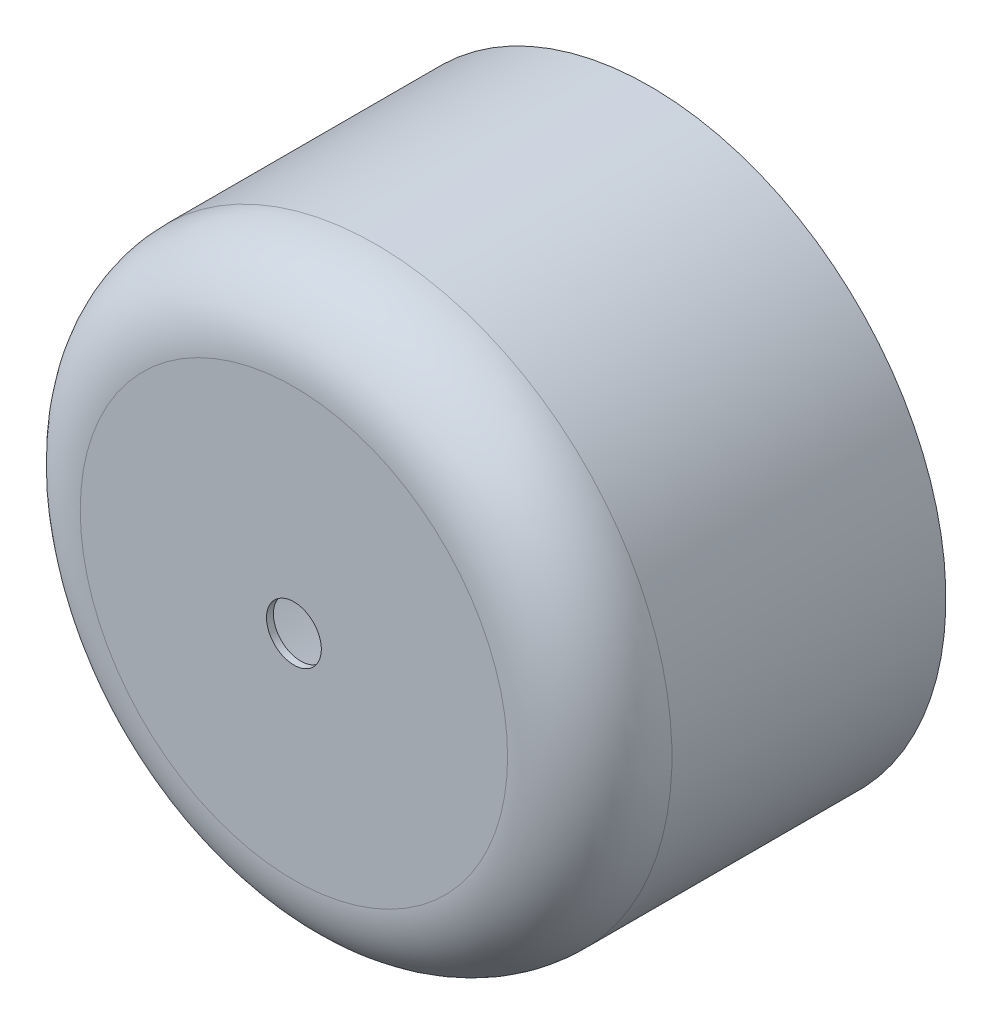
ISO-10303-21;
HEADER;
FILE_DESCRIPTION(('STEP AP214'),'2;1');
FILE_NAME('part.step','',(''),(''),'','','');
FILE_SCHEMA(('AUTOMOTIVE_DESIGN { 1 0 10303 214 1 1 1 1 }'));
ENDSEC;
DATA;
#1=APPLICATION_CONTEXT('core data for automotive mechanical design processes');
#2=APPLICATION_PROTOCOL_DEFINITION('international standard','automotive_design',2000,#1);
#3=PRODUCT_CONTEXT('',#1,'mechanical');
#4=PRODUCT('Part','Part','',(#3));
#5=PRODUCT_RELATED_PRODUCT_CATEGORY('part','',(#4));
#6=PRODUCT_DEFINITION_FORMATION('','',#4);
#7=PRODUCT_DEFINITION_CONTEXT('part definition',#1,'design');
#8=PRODUCT_DEFINITION('design','',#6,#7);
#9=PRODUCT_DEFINITION_SHAPE('','',#8);
#10=(LENGTH_UNIT() NAMED_UNIT(*) SI_UNIT(.MILLI.,.METRE.));
#11=(NAMED_UNIT(*) PLANE_ANGLE_UNIT() SI_UNIT($,.RADIAN.));
#12=(NAMED_UNIT(*) SI_UNIT($,.STERADIAN.) SOLID_ANGLE_UNIT());
#13=UNCERTAINTY_MEASURE_WITH_UNIT(LENGTH_MEASURE(1.E-05),#10,'distance_accuracy_value','');
#14=(GEOMETRIC_REPRESENTATION_CONTEXT(3) GLOBAL_UNCERTAINTY_ASSIGNED_CONTEXT((#13)) GLOBAL_UNIT_ASSIGNED_CONTEXT((#10,
#11,#12)) REPRESENTATION_CONTEXT('',''));
#15=CARTESIAN_POINT('',(0.,0.,0.));
#16=DIRECTION('',(0.,0.,1.));
#17=DIRECTION('',(1.,0.,0.));
#18=AXIS2_PLACEMENT_3D('',#15,#16,#17);
#19=CARTESIAN_POINT('',(10.55,0.,0.));
#20=DIRECTION('',(0.,0.,-1.));
#21=DIRECTION('',(-1.,0.,0.));
#22=AXIS2_PLACEMENT_3D('',#19,#20,#21);
#23=PLANE('',#22);
#24=CARTESIAN_POINT('',(0.,0.,0.));
#25=DIRECTION('',(0.,0.,-1.));
#26=DIRECTION('',(-1.,0.,0.));
#27=AXIS2_PLACEMENT_3D('',#24,#25,#26);
#28=CIRCLE('',#27,10.8);
#29=CARTESIAN_POINT('',(-10.8,0.,0.));
#30=VERTEX_POINT('',#29);
#31=EDGE_CURVE('E10',#30,#30,#28,.T.);
#32=ORIENTED_EDGE('',*,*,#31,.T.);
#33=EDGE_LOOP('',(#32));
#34=FACE_BOUND('',#33,.T.);
#35=CARTESIAN_POINT('',(0.,0.,0.));
#36=DIRECTION('',(0.,0.,-1.));
#37=DIRECTION('',(-1.,0.,0.));
#38=AXIS2_PLACEMENT_3D('',#35,#36,#37);
#39=CIRCLE('',#38,10.55);
#40=CARTESIAN_POINT('',(-10.55,0.,0.));
#41=VERTEX_POINT('',#40);
#42=EDGE_CURVE('E60',#41,#41,#39,.T.);
#43=ORIENTED_EDGE('',*,*,#42,.F.);
#44=EDGE_LOOP('',(#43));
#45=FACE_BOUND('',#44,.T.);
#46=ADVANCED_FACE('F32',(#34,#45),#23,.T.);
#47=CARTESIAN_POINT('',(0.,0.,13.));
#48=DIRECTION('',(0.,0.,-1.));
#49=DIRECTION('',(-1.,0.,0.));
#50=AXIS2_PLACEMENT_3D('',#47,#48,#49);
#51=CYLINDRICAL_SURFACE('',#50,10.8);
#52=CARTESIAN_POINT('',(0.,0.,10.));
#53=DIRECTION('',(0.,0.,-1.));
#54=DIRECTION('',(-1.,0.,0.));
#55=AXIS2_PLACEMENT_3D('',#52,#53,#54);
#56=CIRCLE('',#55,10.8);
#57=CARTESIAN_POINT('',(-10.8,0.,10.));
#58=VERTEX_POINT('',#57);
#59=EDGE_CURVE('E38',#58,#58,#56,.T.);
#60=ORIENTED_EDGE('',*,*,#59,.T.);
#61=EDGE_LOOP('',(#60));
#62=FACE_BOUND('',#61,.T.);
#63=ORIENTED_EDGE('',*,*,#31,.F.);
#64=EDGE_LOOP('',(#63));
#65=FACE_BOUND('',#64,.T.);
#66=ADVANCED_FACE('F68',(#62,#65),#51,.T.);
#67=CARTESIAN_POINT('',(0.,0.,10.));
#68=DIRECTION('',(0.,0.,-1.));
#69=DIRECTION('',(-1.,0.,0.));
#70=AXIS2_PLACEMENT_3D('',#67,#68,#69);
#71=TOROIDAL_SURFACE('',#70,7.8,3.);
#72=CARTESIAN_POINT('',(0.,0.,13.));
#73=DIRECTION('',(0.,0.,-1.));
#74=DIRECTION('',(-1.,0.,0.));
#75=AXIS2_PLACEMENT_3D('',#72,#73,#74);
#76=CIRCLE('',#75,7.8);
#77=CARTESIAN_POINT('',(-7.8,0.,13.));
#78=VERTEX_POINT('',#77);
#79=EDGE_CURVE('E42',#78,#78,#76,.T.);
#80=ORIENTED_EDGE('',*,*,#79,.T.);
#81=EDGE_LOOP('',(#80));
#82=FACE_BOUND('',#81,.T.);
#83=ORIENTED_EDGE('',*,*,#59,.F.);
#84=EDGE_LOOP('',(#83));
#85=FACE_BOUND('',#84,.T.);
#86=ADVANCED_FACE('F72',(#82,#85),#71,.T.);
#87=CARTESIAN_POINT('',(7.8,0.,13.));
#88=DIRECTION('',(0.,0.,1.));
#89=DIRECTION('',(1.,0.,0.));
#90=AXIS2_PLACEMENT_3D('',#87,#88,#89);
#91=PLANE('',#90);
#92=CARTESIAN_POINT('',(0.,0.,13.));
#93=DIRECTION('',(0.,0.,-1.));
#94=DIRECTION('',(-1.,0.,0.));
#95=AXIS2_PLACEMENT_3D('',#92,#93,#94);
#96=CIRCLE('',#95,1.);
#97=CARTESIAN_POINT('',(-1.,0.,13.));
#98=VERTEX_POINT('',#97);
#99=EDGE_CURVE('E46',#98,#98,#96,.T.);
#100=ORIENTED_EDGE('',*,*,#99,.T.);
#101=EDGE_LOOP('',(#100));
#102=FACE_BOUND('',#101,.T.);
#103=ORIENTED_EDGE('',*,*,#79,.F.);
#104=EDGE_LOOP('',(#103));
#105=FACE_BOUND('',#104,.T.);
#106=ADVANCED_FACE('F76',(#102,#105),#91,.T.);
#107=CARTESIAN_POINT('',(0.,0.,13.));
#108=DIRECTION('',(0.,0.,-1.));
#109=DIRECTION('',(-1.,0.,0.));
#110=AXIS2_PLACEMENT_3D('',#107,#108,#109);
#111=CYLINDRICAL_SURFACE('',#110,1.);
#112=CARTESIAN_POINT('',(0.,0.,12.75));
#113=DIRECTION('',(0.,0.,-1.));
#114=DIRECTION('',(-1.,0.,0.));
#115=AXIS2_PLACEMENT_3D('',#112,#113,#114);
#116=CIRCLE('',#115,1.);
#117=CARTESIAN_POINT('',(-1.,0.,12.75));
#118=VERTEX_POINT('',#117);
#119=EDGE_CURVE('E51',#118,#118,#116,.T.);
#120=ORIENTED_EDGE('',*,*,#119,.T.);
#121=EDGE_LOOP('',(#120));
#122=FACE_BOUND('',#121,.T.);
#123=ORIENTED_EDGE('',*,*,#99,.F.);
#124=EDGE_LOOP('',(#123));
#125=FACE_BOUND('',#124,.T.);
#126=ADVANCED_FACE('F83',(#122,#125),#111,.F.);
#127=CARTESIAN_POINT('',(1.,0.,12.75));
#128=DIRECTION('',(0.,0.,-1.));
#129=DIRECTION('',(-1.,0.,0.));
#130=AXIS2_PLACEMENT_3D('',#127,#128,#129);
#131=PLANE('',#130);
#132=CARTESIAN_POINT('',(0.,0.,12.75));
#133=DIRECTION('',(0.,0.,-1.));
#134=DIRECTION('',(-1.,0.,0.));
#135=AXIS2_PLACEMENT_3D('',#132,#133,#134);
#136=CIRCLE('',#135,7.8);
#137=CARTESIAN_POINT('',(-7.8,0.,12.75));
#138=VERTEX_POINT('',#137);
#139=EDGE_CURVE('E54',#138,#138,#136,.T.);
#140=ORIENTED_EDGE('',*,*,#139,.T.);
#141=EDGE_LOOP('',(#140));
#142=FACE_BOUND('',#141,.T.);
#143=ORIENTED_EDGE('',*,*,#119,.F.);
#144=EDGE_LOOP('',(#143));
#145=FACE_BOUND('',#144,.T.);
#146=ADVANCED_FACE('F87',(#142,#145),#131,.T.);
#147=CARTESIAN_POINT('',(0.,0.,10.));
#148=DIRECTION('',(0.,0.,-1.));
#149=DIRECTION('',(-1.,0.,0.));
#150=AXIS2_PLACEMENT_3D('',#147,#148,#149);
#151=TOROIDAL_SURFACE('',#150,7.8,2.75);
#152=CARTESIAN_POINT('',(0.,0.,10.));
#153=DIRECTION('',(0.,0.,-1.));
#154=DIRECTION('',(-1.,0.,0.));
#155=AXIS2_PLACEMENT_3D('',#152,#153,#154);
#156=CIRCLE('',#155,10.55);
#157=CARTESIAN_POINT('',(-10.55,0.,10.));
#158=VERTEX_POINT('',#157);
#159=EDGE_CURVE('E57',#158,#158,#156,.T.);
#160=ORIENTED_EDGE('',*,*,#159,.T.);
#161=EDGE_LOOP('',(#160));
#162=FACE_BOUND('',#161,.T.);
#163=ORIENTED_EDGE('',*,*,#139,.F.);
#164=EDGE_LOOP('',(#163));
#165=FACE_BOUND('',#164,.T.);
#166=ADVANCED_FACE('F91',(#162,#165),#151,.F.);
#167=CARTESIAN_POINT('',(0.,0.,13.));
#168=DIRECTION('',(0.,0.,-1.));
#169=DIRECTION('',(-1.,0.,0.));
#170=AXIS2_PLACEMENT_3D('',#167,#168,#169);
#171=CYLINDRICAL_SURFACE('',#170,10.55);
#172=ORIENTED_EDGE('',*,*,#42,.T.);
#173=EDGE_LOOP('',(#172));
#174=FACE_BOUND('',#173,.T.);
#175=ORIENTED_EDGE('',*,*,#159,.F.);
#176=EDGE_LOOP('',(#175));
#177=FACE_BOUND('',#176,.T.);
#178=ADVANCED_FACE('F64',(#174,#177),#171,.F.);
#179=CLOSED_SHELL('',(#46,#66,#86,#106,#126,#146,#166,#178));
#180=MANIFOLD_SOLID_BREP('B2',#179);
#181=ADVANCED_BREP_SHAPE_REPRESENTATION('',(#18,#180),#14);
#182=SHAPE_DEFINITION_REPRESENTATION(#9,#181);
ENDSEC;
END-ISO-10303-21;
